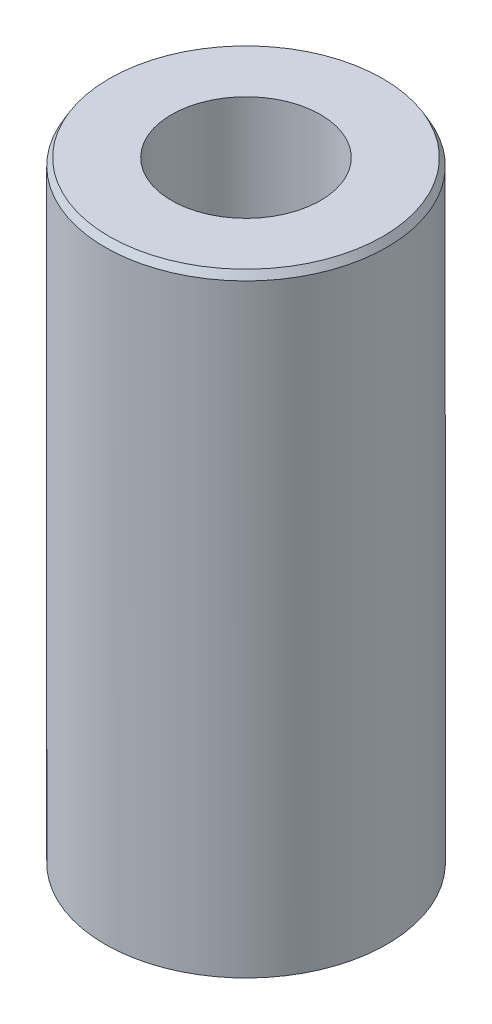
ISO-10303-21;
HEADER;
FILE_DESCRIPTION(('STEP AP214'),'2;1');
FILE_NAME('part.step','',(''),(''),'','','');
FILE_SCHEMA(('AUTOMOTIVE_DESIGN { 1 0 10303 214 1 1 1 1 }'));
ENDSEC;
DATA;
#1=APPLICATION_CONTEXT('core data for automotive mechanical design processes');
#2=APPLICATION_PROTOCOL_DEFINITION('international standard','automotive_design',2000,#1);
#3=PRODUCT_CONTEXT('',#1,'mechanical');
#4=PRODUCT('Part','Part','',(#3));
#5=PRODUCT_RELATED_PRODUCT_CATEGORY('part','',(#4));
#6=PRODUCT_DEFINITION_FORMATION('','',#4);
#7=PRODUCT_DEFINITION_CONTEXT('part definition',#1,'design');
#8=PRODUCT_DEFINITION('design','',#6,#7);
#9=PRODUCT_DEFINITION_SHAPE('','',#8);
#10=(LENGTH_UNIT() NAMED_UNIT(*) SI_UNIT(.MILLI.,.METRE.));
#11=(NAMED_UNIT(*) PLANE_ANGLE_UNIT() SI_UNIT($,.RADIAN.));
#12=(NAMED_UNIT(*) SI_UNIT($,.STERADIAN.) SOLID_ANGLE_UNIT());
#13=UNCERTAINTY_MEASURE_WITH_UNIT(LENGTH_MEASURE(1.E-05),#10,'distance_accuracy_value','');
#14=(GEOMETRIC_REPRESENTATION_CONTEXT(3) GLOBAL_UNCERTAINTY_ASSIGNED_CONTEXT((#13)) GLOBAL_UNIT_ASSIGNED_CONTEXT((#10,
#11,#12)) REPRESENTATION_CONTEXT('',''));
#15=CARTESIAN_POINT('',(0.,0.,0.));
#16=DIRECTION('',(0.,0.,1.));
#17=DIRECTION('',(1.,0.,0.));
#18=AXIS2_PLACEMENT_3D('',#15,#16,#17);
#19=CARTESIAN_POINT('',(0.,120.009170666529,0.));
#20=DIRECTION('',(0.,-1.,0.));
#21=DIRECTION('',(0.,0.,-1.));
#22=AXIS2_PLACEMENT_3D('',#19,#20,#21);
#23=CYLINDRICAL_SURFACE('',#22,27.5);
#24=CARTESIAN_POINT('',(0.,118.596915328009,0.));
#25=DIRECTION('',(0.,1.,0.));
#26=DIRECTION('',(0.,0.,1.));
#27=AXIS2_PLACEMENT_3D('',#24,#25,#26);
#28=CIRCLE('',#27,27.5);
#29=CARTESIAN_POINT('',(0.,118.596915328009,-27.5));
#30=VERTEX_POINT('',#29);
#31=EDGE_CURVE('E50',#30,#30,#28,.F.);
#32=CARTESIAN_POINT('',(0.,0.815365999859249,0.));
#33=DIRECTION('',(0.,1.,0.));
#34=DIRECTION('',(0.,0.,1.));
#35=AXIS2_PLACEMENT_3D('',#32,#33,#34);
#36=CIRCLE('',#35,27.5);
#37=CARTESIAN_POINT('',(0.,0.815365999859249,-27.5));
#38=VERTEX_POINT('',#37);
#39=EDGE_CURVE('E51',#38,#38,#36,.T.);
#40=CARTESIAN_POINT('',(0.,118.596915328009,-27.5));
#41=CARTESIAN_POINT('',(0.,117.370024189174,-27.5));
#42=CARTESIAN_POINT('',(0.,116.143133050339,-27.5));
#43=CARTESIAN_POINT('',(0.,113.689350772669,-27.5));
#44=CARTESIAN_POINT('',(0.,112.462459633834,-27.5));
#45=CARTESIAN_POINT('',(0.,110.008677356164,-27.5));
#46=CARTESIAN_POINT('',(0.,108.78178621733,-27.5));
#47=CARTESIAN_POINT('',(0.,106.32800393966,-27.5));
#48=CARTESIAN_POINT('',(0.,105.101112800825,-27.5));
#49=CARTESIAN_POINT('',(0.,102.647330523155,-27.5));
#50=CARTESIAN_POINT('',(0.,101.42043938432,-27.5));
#51=CARTESIAN_POINT('',(0.,98.9666571066505,-27.5));
#52=CARTESIAN_POINT('',(0.,97.7397659678156,-27.5));
#53=CARTESIAN_POINT('',(0.,95.2859836901458,-27.5));
#54=CARTESIAN_POINT('',(0.,94.0590925513109,-27.5));
#55=CARTESIAN_POINT('',(0.,91.6053102736411,-27.5));
#56=CARTESIAN_POINT('',(0.,90.3784191348062,-27.5));
#57=CARTESIAN_POINT('',(0.,87.9246368571365,-27.5));
#58=CARTESIAN_POINT('',(0.,86.6977457183016,-27.5));
#59=CARTESIAN_POINT('',(0.,84.2439634406318,-27.5));
#60=CARTESIAN_POINT('',(0.,83.0170723017969,-27.5));
#61=CARTESIAN_POINT('',(0.,80.5632900241271,-27.5));
#62=CARTESIAN_POINT('',(0.,79.3363988852922,-27.5));
#63=CARTESIAN_POINT('',(0.,76.8826166076224,-27.5));
#64=CARTESIAN_POINT('',(0.,75.6557254687876,-27.5));
#65=CARTESIAN_POINT('',(0.,73.2019431911178,-27.5));
#66=CARTESIAN_POINT('',(0.,71.9750520522829,-27.5));
#67=CARTESIAN_POINT('',(0.,69.5212697746131,-27.5));
#68=CARTESIAN_POINT('',(0.,68.2943786357782,-27.5));
#69=CARTESIAN_POINT('',(0.,65.8405963581084,-27.5));
#70=CARTESIAN_POINT('',(0.,64.6137052192736,-27.5));
#71=CARTESIAN_POINT('',(0.,62.1599229416038,-27.5));
#72=CARTESIAN_POINT('',(0.,60.9330318027689,-27.5));
#73=CARTESIAN_POINT('',(0.,58.4792495250991,-27.5));
#74=CARTESIAN_POINT('',(0.,57.2523583862642,-27.5));
#75=CARTESIAN_POINT('',(0.,54.7985761085944,-27.5));
#76=CARTESIAN_POINT('',(0.,53.5716849697595,-27.5));
#77=CARTESIAN_POINT('',(0.,51.1179026920898,-27.5));
#78=CARTESIAN_POINT('',(0.,49.8910115532549,-27.5));
#79=CARTESIAN_POINT('',(0.,47.4372292755851,-27.5));
#80=CARTESIAN_POINT('',(0.,46.2103381367502,-27.5));
#81=CARTESIAN_POINT('',(0.,43.7565558590804,-27.5));
#82=CARTESIAN_POINT('',(0.,42.5296647202455,-27.5));
#83=CARTESIAN_POINT('',(0.,40.0758824425757,-27.5));
#84=CARTESIAN_POINT('',(0.,38.8489913037409,-27.5));
#85=CARTESIAN_POINT('',(0.,36.3952090260711,-27.5));
#86=CARTESIAN_POINT('',(0.,35.1683178872362,-27.5));
#87=CARTESIAN_POINT('',(0.,32.7145356095664,-27.5));
#88=CARTESIAN_POINT('',(0.,31.4876444707315,-27.5));
#89=CARTESIAN_POINT('',(0.,29.0338621930617,-27.5));
#90=CARTESIAN_POINT('',(0.,27.8069710542268,-27.5));
#91=CARTESIAN_POINT('',(0.,25.3531887765571,-27.5));
#92=CARTESIAN_POINT('',(0.,24.1262976377222,-27.5));
#93=CARTESIAN_POINT('',(0.,21.6725153600524,-27.5));
#94=CARTESIAN_POINT('',(0.,20.4456242212175,-27.5));
#95=CARTESIAN_POINT('',(0.,17.9918419435477,-27.5));
#96=CARTESIAN_POINT('',(0.,16.7649508047128,-27.5));
#97=CARTESIAN_POINT('',(0.,14.311168527043,-27.5));
#98=CARTESIAN_POINT('',(0.,13.0842773882082,-27.5));
#99=CARTESIAN_POINT('',(0.,10.6304951105384,-27.5));
#100=CARTESIAN_POINT('',(0.,9.40360397170348,-27.5));
#101=CARTESIAN_POINT('',(0.,6.94982169403371,-27.5));
#102=CARTESIAN_POINT('',(0.,5.72293055519882,-27.5));
#103=CARTESIAN_POINT('',(0.,3.26914827752904,-27.5));
#104=CARTESIAN_POINT('',(0.,2.04225713869415,-27.5));
#105=CARTESIAN_POINT('',(0.,0.815365999859249,-27.5));
#106=B_SPLINE_CURVE_WITH_KNOTS('',3,(#40,#41,#42,#43,#44,#45,#46,#47,#48,#49,#50,#51,#52,#53,
#54,#55,#56,#57,#58,#59,#60,#61,#62,#63,#64,#65,#66,#67,#68,#69,#70,#71,#72,#73,#74,#75,#76,#77,
#78,#79,#80,#81,#82,#83,#84,#85,#86,#87,#88,#89,#90,#91,#92,#93,#94,#95,#96,#97,#98,#99,#100,
#101,#102,#103,#104,#105),.UNSPECIFIED.,.F.,.F.,(4,2,2,2,2,2,2,2,2,2,2,2,2,2,2,2,2,2,2,2,2,2,2,
2,2,2,2,2,2,2,2,2,4),(0.,3.68067341650467,7.36134683300935,11.042020249514,14.7226936660187,
18.4033670825234,22.084040499028,25.7647139155327,29.4453873320374,33.126060748542,
36.8067341650467,40.4874075815514,44.1680809980561,47.8487544145607,51.5294278310654,
55.2101012475701,58.8907746640747,62.5714480805794,66.2521214970841,69.9327949135887,
73.6134683300934,77.2941417465981,80.9748151631028,84.6554885796074,88.3361619961121,
92.0168354126168,95.6975088291214,99.3781822456261,103.058855662131,106.739529078635,
110.42020249514,114.100875911645,117.781549328149),.UNSPECIFIED.);
#107=EDGE_CURVE('BSEAM39',#30,#38,#106,.T.);
#108=ORIENTED_EDGE('',*,*,#31,.T.);
#109=ORIENTED_EDGE('',*,*,#39,.T.);
#110=ORIENTED_EDGE('',*,*,#107,.T.);
#111=ORIENTED_EDGE('',*,*,#107,.F.);
#112=EDGE_LOOP('',(#108,#110,#109,#111));
#113=FACE_BOUND('',#112,.T.);
#114=ADVANCED_FACE('F39',(#113),#23,.T.);
#115=CARTESIAN_POINT('',(0.,120.009170666529,0.));
#116=DIRECTION('',(0.,1.,0.));
#117=DIRECTION('',(0.,0.,1.));
#118=AXIS2_PLACEMENT_3D('',#115,#116,#117);
#119=PLANE('',#118);
#120=CARTESIAN_POINT('',(0.,120.009170666529,0.));
#121=DIRECTION('',(0.,1.,0.));
#122=DIRECTION('',(0.,0.,1.));
#123=AXIS2_PLACEMENT_3D('',#120,#121,#122);
#124=CIRCLE('',#123,26.6846340001409);
#125=CARTESIAN_POINT('',(0.,120.009170666529,26.6846340001409));
#126=VERTEX_POINT('',#125);
#127=EDGE_CURVE('E54',#126,#126,#124,.T.);
#128=ORIENTED_EDGE('',*,*,#127,.T.);
#129=EDGE_LOOP('',(#128));
#130=FACE_BOUND('',#129,.T.);
#131=CARTESIAN_POINT('',(0.,120.009170666529,0.));
#132=DIRECTION('',(0.,1.,0.));
#133=DIRECTION('',(0.,0.,1.));
#134=AXIS2_PLACEMENT_3D('',#131,#132,#133);
#135=CIRCLE('',#134,14.5359420307667);
#136=CARTESIAN_POINT('',(0.,120.009170666529,-14.5359420307667));
#137=VERTEX_POINT('',#136);
#138=EDGE_CURVE('E58',#137,#137,#135,.T.);
#139=ORIENTED_EDGE('',*,*,#138,.F.);
#140=EDGE_LOOP('',(#139));
#141=FACE_BOUND('',#140,.T.);
#142=ADVANCED_FACE('F69',(#130,#141),#119,.T.);
#143=CARTESIAN_POINT('',(0.,0.,0.));
#144=DIRECTION('',(0.,1.,0.));
#145=DIRECTION('',(0.,0.,1.));
#146=AXIS2_PLACEMENT_3D('',#143,#144,#145);
#147=PLANE('',#146);
#148=CARTESIAN_POINT('',(0.,0.,0.));
#149=DIRECTION('',(0.,1.,0.));
#150=DIRECTION('',(0.,0.,1.));
#151=AXIS2_PLACEMENT_3D('',#148,#149,#150);
#152=CIRCLE('',#151,26.0877446614796);
#153=CARTESIAN_POINT('',(0.,0.,26.0877446614796));
#154=VERTEX_POINT('',#153);
#155=EDGE_CURVE('E10',#154,#154,#152,.F.);
#156=ORIENTED_EDGE('',*,*,#155,.T.);
#157=EDGE_LOOP('',(#156));
#158=FACE_BOUND('',#157,.T.);
#159=CARTESIAN_POINT('',(0.,0.,0.));
#160=DIRECTION('',(0.,1.,0.));
#161=DIRECTION('',(0.,0.,1.));
#162=AXIS2_PLACEMENT_3D('',#159,#160,#161);
#163=CIRCLE('',#162,14.5359420307667);
#164=CARTESIAN_POINT('',(0.,0.,-14.5359420307667));
#165=VERTEX_POINT('',#164);
#166=EDGE_CURVE('E63',#165,#165,#163,.T.);
#167=ORIENTED_EDGE('',*,*,#166,.T.);
#168=EDGE_LOOP('',(#167));
#169=FACE_BOUND('',#168,.T.);
#170=ADVANCED_FACE('F75',(#158,#169),#147,.F.);
#171=CARTESIAN_POINT('',(0.,120.009170666529,0.));
#172=DIRECTION('',(0.,-1.,0.));
#173=DIRECTION('',(0.,0.,-1.));
#174=AXIS2_PLACEMENT_3D('',#171,#172,#173);
#175=CYLINDRICAL_SURFACE('',#174,14.5359420307667);
#176=CARTESIAN_POINT('',(0.,120.009170666529,-14.5359420307667));
#177=CARTESIAN_POINT('',(0.,118.759075138753,-14.5359420307667));
#178=CARTESIAN_POINT('',(0.,117.508979610976,-14.5359420307667));
#179=CARTESIAN_POINT('',(0.,115.008788555424,-14.5359420307667));
#180=CARTESIAN_POINT('',(0.,113.758693027647,-14.5359420307667));
#181=CARTESIAN_POINT('',(0.,111.258501972094,-14.5359420307667));
#182=CARTESIAN_POINT('',(0.,110.008406444318,-14.5359420307667));
#183=CARTESIAN_POINT('',(0.,107.508215388765,-14.5359420307667));
#184=CARTESIAN_POINT('',(0.,106.258119860989,-14.5359420307667));
#185=CARTESIAN_POINT('',(0.,103.757928805436,-14.5359420307667));
#186=CARTESIAN_POINT('',(0.,102.50783327766,-14.5359420307667));
#187=CARTESIAN_POINT('',(0.,100.007642222107,-14.5359420307667));
#188=CARTESIAN_POINT('',(0.,98.7575466943311,-14.5359420307667));
#189=CARTESIAN_POINT('',(0.,96.2573556387784,-14.5359420307667));
#190=CARTESIAN_POINT('',(0.,95.007260111002,-14.5359420307667));
#191=CARTESIAN_POINT('',(0.,92.5070690554493,-14.5359420307667));
#192=CARTESIAN_POINT('',(0.,91.256973527673,-14.5359420307667));
#193=CARTESIAN_POINT('',(0.,88.7567824721203,-14.5359420307667));
#194=CARTESIAN_POINT('',(0.,87.506686944344,-14.5359420307667));
#195=CARTESIAN_POINT('',(0.,85.0064958887913,-14.5359420307667));
#196=CARTESIAN_POINT('',(0.,83.7564003610149,-14.5359420307667));
#197=CARTESIAN_POINT('',(0.,81.2562093054622,-14.5359420307667));
#198=CARTESIAN_POINT('',(0.,80.0061137776859,-14.5359420307667));
#199=CARTESIAN_POINT('',(0.,77.5059227221332,-14.5359420307667));
#200=CARTESIAN_POINT('',(0.,76.2558271943569,-14.5359420307667));
#201=CARTESIAN_POINT('',(0.,73.7556361388042,-14.5359420307667));
#202=CARTESIAN_POINT('',(0.,72.5055406110279,-14.5359420307667));
#203=CARTESIAN_POINT('',(0.,70.0053495554752,-14.5359420307667));
#204=CARTESIAN_POINT('',(0.,68.7552540276988,-14.5359420307667));
#205=CARTESIAN_POINT('',(0.,66.2550629721461,-14.5359420307667));
#206=CARTESIAN_POINT('',(0.,65.0049674443698,-14.5359420307667));
#207=CARTESIAN_POINT('',(0.,62.5047763888171,-14.5359420307667));
#208=CARTESIAN_POINT('',(0.,61.2546808610408,-14.5359420307667));
#209=CARTESIAN_POINT('',(0.,58.7544898054881,-14.5359420307667));
#210=CARTESIAN_POINT('',(0.,57.5043942777117,-14.5359420307667));
#211=CARTESIAN_POINT('',(0.,55.0042032221591,-14.5359420307667));
#212=CARTESIAN_POINT('',(0.,53.7541076943827,-14.5359420307667));
#213=CARTESIAN_POINT('',(0.,51.25391663883,-14.5359420307667));
#214=CARTESIAN_POINT('',(0.,50.0038211110537,-14.5359420307667));
#215=CARTESIAN_POINT('',(0.,47.503630055501,-14.5359420307667));
#216=CARTESIAN_POINT('',(0.,46.2535345277247,-14.5359420307667));
#217=CARTESIAN_POINT('',(0.,43.753343472172,-14.5359420307667));
#218=CARTESIAN_POINT('',(0.,42.5032479443956,-14.5359420307667));
#219=CARTESIAN_POINT('',(0.,40.003056888843,-14.5359420307667));
#220=CARTESIAN_POINT('',(0.,38.7529613610666,-14.5359420307667));
#221=CARTESIAN_POINT('',(0.,36.2527703055139,-14.5359420307667));
#222=CARTESIAN_POINT('',(0.,35.0026747777376,-14.5359420307667));
#223=CARTESIAN_POINT('',(0.,32.5024837221849,-14.5359420307667));
#224=CARTESIAN_POINT('',(0.,31.2523881944086,-14.5359420307667));
#225=CARTESIAN_POINT('',(0.,28.7521971388559,-14.5359420307667));
#226=CARTESIAN_POINT('',(0.,27.5021016110795,-14.5359420307667));
#227=CARTESIAN_POINT('',(0.,25.0019105555268,-14.5359420307667));
#228=CARTESIAN_POINT('',(0.,23.7518150277505,-14.5359420307667));
#229=CARTESIAN_POINT('',(0.,21.2516239721978,-14.5359420307667));
#230=CARTESIAN_POINT('',(0.,20.0015284444215,-14.5359420307667));
#231=CARTESIAN_POINT('',(0.,17.5013373888688,-14.5359420307667));
#232=CARTESIAN_POINT('',(0.,16.2512418610924,-14.5359420307667));
#233=CARTESIAN_POINT('',(0.,13.7510508055398,-14.5359420307667));
#234=CARTESIAN_POINT('',(0.,12.5009552777634,-14.5359420307667));
#235=CARTESIAN_POINT('',(0.,10.0007642222107,-14.5359420307667));
#236=CARTESIAN_POINT('',(0.,8.75066869443439,-14.5359420307667));
#237=CARTESIAN_POINT('',(0.,6.2504776388817,-14.5359420307667));
#238=CARTESIAN_POINT('',(0.,5.00038211110536,-14.5359420307667));
#239=CARTESIAN_POINT('',(0.,2.50019105555267,-14.5359420307667));
#240=CARTESIAN_POINT('',(0.,1.25009552777633,-14.5359420307667));
#241=CARTESIAN_POINT('',(0.,0.,-14.5359420307667));
#242=B_SPLINE_CURVE_WITH_KNOTS('',3,(#176,#177,#178,#179,#180,#181,#182,#183,#184,#185,#186,
#187,#188,#189,#190,#191,#192,#193,#194,#195,#196,#197,#198,#199,#200,#201,#202,#203,#204,#205,
#206,#207,#208,#209,#210,#211,#212,#213,#214,#215,#216,#217,#218,#219,#220,#221,#222,#223,#224,
#225,#226,#227,#228,#229,#230,#231,#232,#233,#234,#235,#236,#237,#238,#239,#240,#241),
.UNSPECIFIED.,.F.,.F.,(4,2,2,2,2,2,2,2,2,2,2,2,2,2,2,2,2,2,2,2,2,2,2,2,2,2,2,2,2,2,2,2,4),(0.,
3.75028658332903,7.50057316665806,11.2508597499871,15.0011463333161,18.7514329166451,
22.5017194999742,26.2520060833032,30.0022926666322,33.7525792499613,37.5028658332903,
41.2531524166193,45.0034389999483,48.7537255832774,52.5040121666064,56.2542987499354,
60.0045853332645,63.7548719165935,67.5051584999225,71.2554450832515,75.0057316665806,
78.7560182499096,82.5063048332386,86.2565914165676,90.0068779998967,93.7571645832257,
97.5074511665547,101.257737749884,105.008024333213,108.758310916542,112.508597499871,
116.2588840832,120.009170666529),.UNSPECIFIED.);
#243=EDGE_CURVE('BSEAM70',#137,#165,#242,.T.);
#244=ORIENTED_EDGE('',*,*,#138,.T.);
#245=ORIENTED_EDGE('',*,*,#166,.F.);
#246=ORIENTED_EDGE('',*,*,#243,.T.);
#247=ORIENTED_EDGE('',*,*,#243,.F.);
#248=EDGE_LOOP('',(#244,#246,#245,#247));
#249=FACE_BOUND('',#248,.T.);
#250=ADVANCED_FACE('F70',(#249),#175,.F.);
#251=CARTESIAN_POINT('',(0.,120.009170666529,0.));
#252=DIRECTION('',(0.,-1.,0.));
#253=DIRECTION('',(0.,0.,-1.));
#254=AXIS2_PLACEMENT_3D('',#251,#252,#253);
#255=CONICAL_SURFACE('',#254,26.6846340001409,0.523598775598292);
#256=ORIENTED_EDGE('',*,*,#31,.F.);
#257=EDGE_LOOP('',(#256));
#258=FACE_BOUND('',#257,.T.);
#259=ORIENTED_EDGE('',*,*,#127,.F.);
#260=EDGE_LOOP('',(#259));
#261=FACE_BOUND('',#260,.T.);
#262=ADVANCED_FACE('F81',(#258,#261),#255,.T.);
#263=CARTESIAN_POINT('',(0.,0.815365999859249,0.));
#264=DIRECTION('',(0.,1.,0.));
#265=DIRECTION('',(0.,0.,1.));
#266=AXIS2_PLACEMENT_3D('',#263,#264,#265);
#267=CONICAL_SURFACE('',#266,27.5,1.04719755119661);
#268=ORIENTED_EDGE('',*,*,#155,.F.);
#269=EDGE_LOOP('',(#268));
#270=FACE_BOUND('',#269,.T.);
#271=ORIENTED_EDGE('',*,*,#39,.F.);
#272=EDGE_LOOP('',(#271));
#273=FACE_BOUND('',#272,.T.);
#274=ADVANCED_FACE('F45',(#270,#273),#267,.T.);
#275=CLOSED_SHELL('',(#114,#142,#170,#250,#262,#274));
#276=MANIFOLD_SOLID_BREP('B2',#275);
#277=ADVANCED_BREP_SHAPE_REPRESENTATION('',(#18,#276),#14);
#278=SHAPE_DEFINITION_REPRESENTATION(#9,#277);
ENDSEC;
END-ISO-10303-21;
